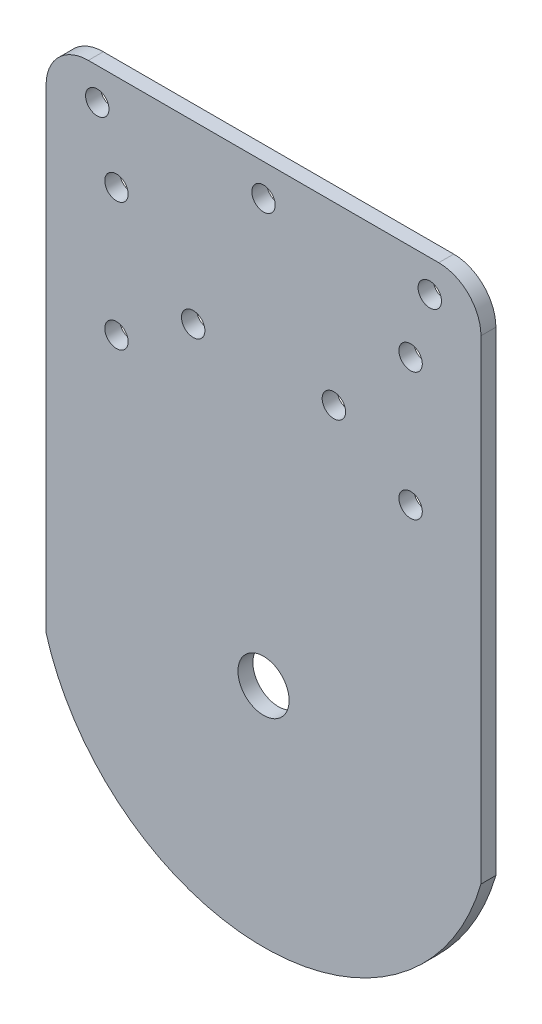
ISO-10303-21;
HEADER;
FILE_DESCRIPTION(('STEP AP214'),'2;1');
FILE_NAME('part.step','',(''),(''),'','','');
FILE_SCHEMA(('AUTOMOTIVE_DESIGN { 1 0 10303 214 1 1 1 1 }'));
ENDSEC;
DATA;
#1=APPLICATION_CONTEXT('core data for automotive mechanical design processes');
#2=APPLICATION_PROTOCOL_DEFINITION('international standard','automotive_design',2000,#1);
#3=PRODUCT_CONTEXT('',#1,'mechanical');
#4=PRODUCT('Part','Part','',(#3));
#5=PRODUCT_RELATED_PRODUCT_CATEGORY('part','',(#4));
#6=PRODUCT_DEFINITION_FORMATION('','',#4);
#7=PRODUCT_DEFINITION_CONTEXT('part definition',#1,'design');
#8=PRODUCT_DEFINITION('design','',#6,#7);
#9=PRODUCT_DEFINITION_SHAPE('','',#8);
#10=(LENGTH_UNIT() NAMED_UNIT(*) SI_UNIT(.MILLI.,.METRE.));
#11=(NAMED_UNIT(*) PLANE_ANGLE_UNIT() SI_UNIT($,.RADIAN.));
#12=(NAMED_UNIT(*) SI_UNIT($,.STERADIAN.) SOLID_ANGLE_UNIT());
#13=UNCERTAINTY_MEASURE_WITH_UNIT(LENGTH_MEASURE(1.E-05),#10,'distance_accuracy_value','');
#14=(GEOMETRIC_REPRESENTATION_CONTEXT(3) GLOBAL_UNCERTAINTY_ASSIGNED_CONTEXT((#13)) GLOBAL_UNIT_ASSIGNED_CONTEXT((#10,
#11,#12)) REPRESENTATION_CONTEXT('',''));
#15=CARTESIAN_POINT('',(0.,0.,0.));
#16=DIRECTION('',(0.,0.,1.));
#17=DIRECTION('',(1.,0.,0.));
#18=AXIS2_PLACEMENT_3D('',#15,#16,#17);
#19=CARTESIAN_POINT('',(0.,0.,2.3368));
#20=DIRECTION('',(0.,0.,1.));
#21=DIRECTION('',(1.,0.,0.));
#22=AXIS2_PLACEMENT_3D('',#19,#20,#21);
#23=PLANE('',#22);
#24=CARTESIAN_POINT('',(-2.15991369565433E-12,66.0000000000004,2.3368));
#25=DIRECTION('',(0.,0.,1.));
#26=DIRECTION('',(1.,0.,0.));
#27=AXIS2_PLACEMENT_3D('',#24,#25,#26);
#28=CIRCLE('',#27,1.8288);
#29=CARTESIAN_POINT('',(1.82879999999784,66.0000000000004,2.3368));
#30=VERTEX_POINT('',#29);
#31=EDGE_CURVE('E318',#30,#30,#28,.T.);
#32=ORIENTED_EDGE('',*,*,#31,.F.);
#33=EDGE_LOOP('',(#32));
#34=FACE_BOUND('',#33,.T.);
#35=CARTESIAN_POINT('',(10.9999999999978,43.5000000000004,2.3368));
#36=DIRECTION('',(0.,0.,1.));
#37=DIRECTION('',(1.,0.,0.));
#38=AXIS2_PLACEMENT_3D('',#35,#36,#37);
#39=CIRCLE('',#38,1.8288);
#40=CARTESIAN_POINT('',(12.8287999999978,43.5000000000004,2.3368));
#41=VERTEX_POINT('',#40);
#42=EDGE_CURVE('E320',#41,#41,#39,.T.);
#43=ORIENTED_EDGE('',*,*,#42,.F.);
#44=EDGE_LOOP('',(#43));
#45=FACE_BOUND('',#44,.T.);
#46=CARTESIAN_POINT('',(22.9999999999978,36.0000000000004,2.3368));
#47=DIRECTION('',(0.,0.,1.));
#48=DIRECTION('',(1.,0.,0.));
#49=AXIS2_PLACEMENT_3D('',#46,#47,#48);
#50=CIRCLE('',#49,1.8288);
#51=CARTESIAN_POINT('',(24.8287999999978,36.0000000000004,2.3368));
#52=VERTEX_POINT('',#51);
#53=EDGE_CURVE('E328',#52,#52,#50,.T.);
#54=ORIENTED_EDGE('',*,*,#53,.F.);
#55=EDGE_LOOP('',(#54));
#56=FACE_BOUND('',#55,.T.);
#57=CARTESIAN_POINT('',(22.9999999999978,56.0000000000004,2.3368));
#58=DIRECTION('',(0.,0.,1.));
#59=DIRECTION('',(1.,0.,0.));
#60=AXIS2_PLACEMENT_3D('',#57,#58,#59);
#61=CIRCLE('',#60,1.8288);
#62=CARTESIAN_POINT('',(24.8287999999978,56.0000000000004,2.3368));
#63=VERTEX_POINT('',#62);
#64=EDGE_CURVE('E334',#63,#63,#61,.T.);
#65=ORIENTED_EDGE('',*,*,#64,.F.);
#66=EDGE_LOOP('',(#65));
#67=FACE_BOUND('',#66,.T.);
#68=CARTESIAN_POINT('',(25.9999999999978,66.0000000000004,2.3368));
#69=DIRECTION('',(0.,0.,1.));
#70=DIRECTION('',(1.,0.,0.));
#71=AXIS2_PLACEMENT_3D('',#68,#69,#70);
#72=CIRCLE('',#71,1.8288);
#73=CARTESIAN_POINT('',(27.8287999999978,66.0000000000004,2.3368));
#74=VERTEX_POINT('',#73);
#75=EDGE_CURVE('E340',#74,#74,#72,.T.);
#76=ORIENTED_EDGE('',*,*,#75,.F.);
#77=EDGE_LOOP('',(#76));
#78=FACE_BOUND('',#77,.T.);
#79=CARTESIAN_POINT('',(-22.9999999999978,36.0000000000004,2.3368));
#80=DIRECTION('',(0.,0.,1.));
#81=DIRECTION('',(1.,0.,0.));
#82=AXIS2_PLACEMENT_3D('',#79,#80,#81);
#83=CIRCLE('',#82,1.8288);
#84=CARTESIAN_POINT('',(-21.1711999999978,36.0000000000004,2.3368));
#85=VERTEX_POINT('',#84);
#86=EDGE_CURVE('E346',#85,#85,#83,.T.);
#87=ORIENTED_EDGE('',*,*,#86,.F.);
#88=EDGE_LOOP('',(#87));
#89=FACE_BOUND('',#88,.T.);
#90=CARTESIAN_POINT('',(-10.9999999999978,43.5000000000004,2.3368));
#91=DIRECTION('',(0.,0.,1.));
#92=DIRECTION('',(1.,0.,0.));
#93=AXIS2_PLACEMENT_3D('',#90,#91,#92);
#94=CIRCLE('',#93,1.8288);
#95=CARTESIAN_POINT('',(-9.17119999999779,43.5000000000004,2.3368));
#96=VERTEX_POINT('',#95);
#97=EDGE_CURVE('E352',#96,#96,#94,.T.);
#98=ORIENTED_EDGE('',*,*,#97,.F.);
#99=EDGE_LOOP('',(#98));
#100=FACE_BOUND('',#99,.T.);
#101=CARTESIAN_POINT('',(-22.9999999999978,56.0000000000004,2.3368));
#102=DIRECTION('',(0.,0.,1.));
#103=DIRECTION('',(1.,0.,0.));
#104=AXIS2_PLACEMENT_3D('',#101,#102,#103);
#105=CIRCLE('',#104,1.8288);
#106=CARTESIAN_POINT('',(-21.1711999999978,56.0000000000004,2.3368));
#107=VERTEX_POINT('',#106);
#108=EDGE_CURVE('E358',#107,#107,#105,.T.);
#109=ORIENTED_EDGE('',*,*,#108,.F.);
#110=EDGE_LOOP('',(#109));
#111=FACE_BOUND('',#110,.T.);
#112=CARTESIAN_POINT('',(-25.9999999999978,66.0000000000004,2.3368));
#113=DIRECTION('',(0.,0.,1.));
#114=DIRECTION('',(1.,0.,0.));
#115=AXIS2_PLACEMENT_3D('',#112,#113,#114);
#116=CIRCLE('',#115,1.8288);
#117=CARTESIAN_POINT('',(-24.1711999999978,66.0000000000004,2.3368));
#118=VERTEX_POINT('',#117);
#119=EDGE_CURVE('E364',#118,#118,#116,.T.);
#120=ORIENTED_EDGE('',*,*,#119,.F.);
#121=EDGE_LOOP('',(#120));
#122=FACE_BOUND('',#121,.T.);
#123=DIRECTION('',(0.,1.,0.));
#124=VECTOR('',#123,1.);
#125=CARTESIAN_POINT('',(33.9999999999978,-9.85697722428106,2.3368));
#126=LINE('',#125,#124);
#127=CARTESIAN_POINT('',(33.9999999999978,-9.85697722428106,2.3368));
#128=VERTEX_POINT('',#127);
#129=CARTESIAN_POINT('',(33.9999999999978,64.4000000000004,2.3368));
#130=VERTEX_POINT('',#129);
#131=EDGE_CURVE('E86',#128,#130,#126,.T.);
#132=ORIENTED_EDGE('',*,*,#131,.T.);
#133=CARTESIAN_POINT('',(27.3999999999978,64.4000000000004,2.3368));
#134=DIRECTION('',(0.,0.,1.));
#135=DIRECTION('',(1.,0.,0.));
#136=AXIS2_PLACEMENT_3D('',#133,#134,#135);
#137=CIRCLE('',#136,6.6);
#138=CARTESIAN_POINT('',(27.3999999999978,71.0000000000004,2.3368));
#139=VERTEX_POINT('',#138);
#140=EDGE_CURVE('E41',#130,#139,#137,.T.);
#141=ORIENTED_EDGE('',*,*,#140,.T.);
#142=DIRECTION('',(-1.,0.,0.));
#143=VECTOR('',#142,1.);
#144=CARTESIAN_POINT('',(33.9999999999978,71.0000000000004,2.3368));
#145=LINE('',#144,#143);
#146=CARTESIAN_POINT('',(-27.4000000000022,71.0000000000004,2.3368));
#147=VERTEX_POINT('',#146);
#148=EDGE_CURVE('E93',#139,#147,#145,.T.);
#149=ORIENTED_EDGE('',*,*,#148,.T.);
#150=CARTESIAN_POINT('',(-27.4000000000022,64.4000000000004,2.3368));
#151=DIRECTION('',(0.,0.,1.));
#152=DIRECTION('',(1.,0.,0.));
#153=AXIS2_PLACEMENT_3D('',#150,#151,#152);
#154=CIRCLE('',#153,6.6);
#155=CARTESIAN_POINT('',(-34.0000000000022,64.4000000000004,2.3368));
#156=VERTEX_POINT('',#155);
#157=EDGE_CURVE('E48',#147,#156,#154,.T.);
#158=ORIENTED_EDGE('',*,*,#157,.T.);
#159=DIRECTION('',(0.,-1.,0.));
#160=VECTOR('',#159,1.);
#161=CARTESIAN_POINT('',(-34.0000000000022,-9.85697722428104,2.3368));
#162=LINE('',#161,#160);
#163=CARTESIAN_POINT('',(-34.0000000000022,-9.85697722428104,2.3368));
#164=VERTEX_POINT('',#163);
#165=EDGE_CURVE('E98',#156,#164,#162,.T.);
#166=ORIENTED_EDGE('',*,*,#165,.T.);
#167=CARTESIAN_POINT('',(0.,0.,2.3368));
#168=DIRECTION('',(0.,0.,1.));
#169=DIRECTION('',(1.,0.,0.));
#170=AXIS2_PLACEMENT_3D('',#167,#168,#169);
#171=CIRCLE('',#170,35.3999999999999);
#172=EDGE_CURVE('E94',#164,#128,#171,.T.);
#173=ORIENTED_EDGE('',*,*,#172,.T.);
#174=EDGE_LOOP('',(#132,#141,#149,#158,#166,#173));
#175=FACE_BOUND('',#174,.T.);
#176=CARTESIAN_POINT('',(0.,0.,2.3368));
#177=DIRECTION('',(0.,0.,1.));
#178=DIRECTION('',(1.,0.,0.));
#179=AXIS2_PLACEMENT_3D('',#176,#177,#178);
#180=CIRCLE('',#179,4.);
#181=CARTESIAN_POINT('',(4.,0.,2.3368));
#182=VERTEX_POINT('',#181);
#183=EDGE_CURVE('E139',#182,#182,#180,.T.);
#184=ORIENTED_EDGE('',*,*,#183,.F.);
#185=EDGE_LOOP('',(#184));
#186=FACE_BOUND('',#185,.T.);
#187=ADVANCED_FACE('F33',(#34,#45,#56,#67,#78,#89,#100,#111,#122,#175,#186),#23,.T.);
#188=CARTESIAN_POINT('',(0.,0.,0.));
#189=DIRECTION('',(0.,0.,1.));
#190=DIRECTION('',(1.,0.,0.));
#191=AXIS2_PLACEMENT_3D('',#188,#189,#190);
#192=PLANE('',#191);
#193=CARTESIAN_POINT('',(-2.15991369565433E-12,66.0000000000004,0.));
#194=DIRECTION('',(0.,0.,1.));
#195=DIRECTION('',(1.,0.,0.));
#196=AXIS2_PLACEMENT_3D('',#193,#194,#195);
#197=CIRCLE('',#196,1.8288);
#198=CARTESIAN_POINT('',(1.82879999999784,66.0000000000004,0.));
#199=VERTEX_POINT('',#198);
#200=EDGE_CURVE('E316',#199,#199,#197,.T.);
#201=ORIENTED_EDGE('',*,*,#200,.T.);
#202=EDGE_LOOP('',(#201));
#203=FACE_BOUND('',#202,.T.);
#204=CARTESIAN_POINT('',(10.9999999999978,43.5000000000004,0.));
#205=DIRECTION('',(0.,0.,1.));
#206=DIRECTION('',(1.,0.,0.));
#207=AXIS2_PLACEMENT_3D('',#204,#205,#206);
#208=CIRCLE('',#207,1.8288);
#209=CARTESIAN_POINT('',(12.8287999999978,43.5000000000004,0.));
#210=VERTEX_POINT('',#209);
#211=EDGE_CURVE('E325',#210,#210,#208,.T.);
#212=ORIENTED_EDGE('',*,*,#211,.T.);
#213=EDGE_LOOP('',(#212));
#214=FACE_BOUND('',#213,.T.);
#215=CARTESIAN_POINT('',(22.9999999999978,36.0000000000004,0.));
#216=DIRECTION('',(0.,0.,1.));
#217=DIRECTION('',(1.,0.,0.));
#218=AXIS2_PLACEMENT_3D('',#215,#216,#217);
#219=CIRCLE('',#218,1.8288);
#220=CARTESIAN_POINT('',(24.8287999999978,36.0000000000004,0.));
#221=VERTEX_POINT('',#220);
#222=EDGE_CURVE('E331',#221,#221,#219,.T.);
#223=ORIENTED_EDGE('',*,*,#222,.T.);
#224=EDGE_LOOP('',(#223));
#225=FACE_BOUND('',#224,.T.);
#226=CARTESIAN_POINT('',(22.9999999999978,56.0000000000004,0.));
#227=DIRECTION('',(0.,0.,1.));
#228=DIRECTION('',(1.,0.,0.));
#229=AXIS2_PLACEMENT_3D('',#226,#227,#228);
#230=CIRCLE('',#229,1.8288);
#231=CARTESIAN_POINT('',(24.8287999999978,56.0000000000004,0.));
#232=VERTEX_POINT('',#231);
#233=EDGE_CURVE('E337',#232,#232,#230,.T.);
#234=ORIENTED_EDGE('',*,*,#233,.T.);
#235=EDGE_LOOP('',(#234));
#236=FACE_BOUND('',#235,.T.);
#237=CARTESIAN_POINT('',(25.9999999999978,66.0000000000004,0.));
#238=DIRECTION('',(0.,0.,1.));
#239=DIRECTION('',(1.,0.,0.));
#240=AXIS2_PLACEMENT_3D('',#237,#238,#239);
#241=CIRCLE('',#240,1.8288);
#242=CARTESIAN_POINT('',(27.8287999999978,66.0000000000004,0.));
#243=VERTEX_POINT('',#242);
#244=EDGE_CURVE('E343',#243,#243,#241,.T.);
#245=ORIENTED_EDGE('',*,*,#244,.T.);
#246=EDGE_LOOP('',(#245));
#247=FACE_BOUND('',#246,.T.);
#248=CARTESIAN_POINT('',(-22.9999999999978,36.0000000000004,0.));
#249=DIRECTION('',(0.,0.,1.));
#250=DIRECTION('',(1.,0.,0.));
#251=AXIS2_PLACEMENT_3D('',#248,#249,#250);
#252=CIRCLE('',#251,1.8288);
#253=CARTESIAN_POINT('',(-21.1711999999978,36.0000000000004,0.));
#254=VERTEX_POINT('',#253);
#255=EDGE_CURVE('E349',#254,#254,#252,.T.);
#256=ORIENTED_EDGE('',*,*,#255,.T.);
#257=EDGE_LOOP('',(#256));
#258=FACE_BOUND('',#257,.T.);
#259=CARTESIAN_POINT('',(-10.9999999999978,43.5000000000004,0.));
#260=DIRECTION('',(0.,0.,1.));
#261=DIRECTION('',(1.,0.,0.));
#262=AXIS2_PLACEMENT_3D('',#259,#260,#261);
#263=CIRCLE('',#262,1.8288);
#264=CARTESIAN_POINT('',(-9.17119999999779,43.5000000000004,0.));
#265=VERTEX_POINT('',#264);
#266=EDGE_CURVE('E355',#265,#265,#263,.T.);
#267=ORIENTED_EDGE('',*,*,#266,.T.);
#268=EDGE_LOOP('',(#267));
#269=FACE_BOUND('',#268,.T.);
#270=CARTESIAN_POINT('',(-22.9999999999978,56.0000000000004,0.));
#271=DIRECTION('',(0.,0.,1.));
#272=DIRECTION('',(1.,0.,0.));
#273=AXIS2_PLACEMENT_3D('',#270,#271,#272);
#274=CIRCLE('',#273,1.8288);
#275=CARTESIAN_POINT('',(-21.1711999999978,56.0000000000004,0.));
#276=VERTEX_POINT('',#275);
#277=EDGE_CURVE('E361',#276,#276,#274,.T.);
#278=ORIENTED_EDGE('',*,*,#277,.T.);
#279=EDGE_LOOP('',(#278));
#280=FACE_BOUND('',#279,.T.);
#281=CARTESIAN_POINT('',(-25.9999999999978,66.0000000000004,0.));
#282=DIRECTION('',(0.,0.,1.));
#283=DIRECTION('',(1.,0.,0.));
#284=AXIS2_PLACEMENT_3D('',#281,#282,#283);
#285=CIRCLE('',#284,1.8288);
#286=CARTESIAN_POINT('',(-24.1711999999978,66.0000000000004,0.));
#287=VERTEX_POINT('',#286);
#288=EDGE_CURVE('E367',#287,#287,#285,.T.);
#289=ORIENTED_EDGE('',*,*,#288,.T.);
#290=EDGE_LOOP('',(#289));
#291=FACE_BOUND('',#290,.T.);
#292=DIRECTION('',(-1.,0.,0.));
#293=VECTOR('',#292,1.);
#294=CARTESIAN_POINT('',(33.9999999999978,71.0000000000004,0.));
#295=LINE('',#294,#293);
#296=CARTESIAN_POINT('',(27.3999999999978,71.0000000000004,0.));
#297=VERTEX_POINT('',#296);
#298=CARTESIAN_POINT('',(-27.4000000000022,71.0000000000004,0.));
#299=VERTEX_POINT('',#298);
#300=EDGE_CURVE('E136',#297,#299,#295,.T.);
#301=ORIENTED_EDGE('',*,*,#300,.F.);
#302=CARTESIAN_POINT('',(27.3999999999978,64.4000000000004,0.));
#303=DIRECTION('',(0.,0.,1.));
#304=DIRECTION('',(1.,0.,0.));
#305=AXIS2_PLACEMENT_3D('',#302,#303,#304);
#306=CIRCLE('',#305,6.6);
#307=CARTESIAN_POINT('',(33.9999999999978,64.4000000000004,0.));
#308=VERTEX_POINT('',#307);
#309=EDGE_CURVE('E119',#297,#308,#306,.F.);
#310=ORIENTED_EDGE('',*,*,#309,.T.);
#311=DIRECTION('',(0.,1.,0.));
#312=VECTOR('',#311,1.);
#313=CARTESIAN_POINT('',(33.9999999999978,-9.85697722428106,0.));
#314=LINE('',#313,#312);
#315=CARTESIAN_POINT('',(33.9999999999978,-9.85697722428106,0.));
#316=VERTEX_POINT('',#315);
#317=EDGE_CURVE('E135',#316,#308,#314,.T.);
#318=ORIENTED_EDGE('',*,*,#317,.F.);
#319=CARTESIAN_POINT('',(0.,0.,0.));
#320=DIRECTION('',(0.,0.,1.));
#321=DIRECTION('',(1.,0.,0.));
#322=AXIS2_PLACEMENT_3D('',#319,#320,#321);
#323=CIRCLE('',#322,35.3999999999999);
#324=CARTESIAN_POINT('',(-34.0000000000022,-9.85697722428104,0.));
#325=VERTEX_POINT('',#324);
#326=EDGE_CURVE('E106',#325,#316,#323,.T.);
#327=ORIENTED_EDGE('',*,*,#326,.F.);
#328=DIRECTION('',(0.,-1.,0.));
#329=VECTOR('',#328,1.);
#330=CARTESIAN_POINT('',(-34.0000000000022,-9.85697722428104,0.));
#331=LINE('',#330,#329);
#332=CARTESIAN_POINT('',(-34.0000000000022,64.4000000000004,0.));
#333=VERTEX_POINT('',#332);
#334=EDGE_CURVE('E102',#333,#325,#331,.T.);
#335=ORIENTED_EDGE('',*,*,#334,.F.);
#336=CARTESIAN_POINT('',(-27.4000000000022,64.4000000000004,0.));
#337=DIRECTION('',(0.,0.,1.));
#338=DIRECTION('',(1.,0.,0.));
#339=AXIS2_PLACEMENT_3D('',#336,#337,#338);
#340=CIRCLE('',#339,6.6);
#341=EDGE_CURVE('E117',#333,#299,#340,.F.);
#342=ORIENTED_EDGE('',*,*,#341,.T.);
#343=EDGE_LOOP('',(#301,#310,#318,#327,#335,#342));
#344=FACE_BOUND('',#343,.T.);
#345=CARTESIAN_POINT('',(0.,0.,0.));
#346=DIRECTION('',(0.,0.,1.));
#347=DIRECTION('',(1.,0.,0.));
#348=AXIS2_PLACEMENT_3D('',#345,#346,#347);
#349=CIRCLE('',#348,4.);
#350=CARTESIAN_POINT('',(4.,0.,0.));
#351=VERTEX_POINT('',#350);
#352=EDGE_CURVE('E370',#351,#351,#349,.T.);
#353=ORIENTED_EDGE('',*,*,#352,.T.);
#354=EDGE_LOOP('',(#353));
#355=FACE_BOUND('',#354,.T.);
#356=ADVANCED_FACE('F133',(#203,#214,#225,#236,#247,#258,#269,#280,#291,#344,#355),#192,.F.);
#357=CARTESIAN_POINT('',(0.,0.,2.3368));
#358=DIRECTION('',(0.,0.,-1.));
#359=DIRECTION('',(-1.,0.,0.));
#360=AXIS2_PLACEMENT_3D('',#357,#358,#359);
#361=CYLINDRICAL_SURFACE('',#360,35.3999999999999);
#362=ORIENTED_EDGE('',*,*,#326,.T.);
#363=DIRECTION('',(0.,0.,-1.));
#364=VECTOR('',#363,1.);
#365=CARTESIAN_POINT('',(33.9999999999978,-9.85697722428106,2.3368));
#366=LINE('',#365,#364);
#367=EDGE_CURVE('E90',#128,#316,#366,.T.);
#368=ORIENTED_EDGE('',*,*,#367,.F.);
#369=ORIENTED_EDGE('',*,*,#172,.F.);
#370=DIRECTION('',(0.,0.,-1.));
#371=VECTOR('',#370,1.);
#372=CARTESIAN_POINT('',(-34.0000000000022,-9.85697722428104,2.3368));
#373=LINE('',#372,#371);
#374=EDGE_CURVE('E108',#164,#325,#373,.T.);
#375=ORIENTED_EDGE('',*,*,#374,.T.);
#376=EDGE_LOOP('',(#362,#368,#369,#375));
#377=FACE_BOUND('',#376,.T.);
#378=ADVANCED_FACE('F104',(#377),#361,.T.);
#379=CARTESIAN_POINT('',(33.9999999999978,-9.85697722428106,2.3368));
#380=DIRECTION('',(-1.,0.,0.));
#381=DIRECTION('',(0.,-1.,0.));
#382=AXIS2_PLACEMENT_3D('',#379,#380,#381);
#383=PLANE('',#382);
#384=ORIENTED_EDGE('',*,*,#317,.T.);
#385=DIRECTION('',(0.,0.,-1.));
#386=VECTOR('',#385,1.);
#387=CARTESIAN_POINT('',(33.9999999999978,64.4000000000004,2.3368));
#388=LINE('',#387,#386);
#389=EDGE_CURVE('E56',#308,#130,#388,.F.);
#390=ORIENTED_EDGE('',*,*,#389,.T.);
#391=ORIENTED_EDGE('',*,*,#131,.F.);
#392=ORIENTED_EDGE('',*,*,#367,.T.);
#393=EDGE_LOOP('',(#384,#390,#391,#392));
#394=FACE_BOUND('',#393,.T.);
#395=ADVANCED_FACE('F88',(#394),#383,.F.);
#396=CARTESIAN_POINT('',(33.9999999999978,71.0000000000004,2.3368));
#397=DIRECTION('',(0.,-1.,0.));
#398=DIRECTION('',(0.,0.,-1.));
#399=AXIS2_PLACEMENT_3D('',#396,#397,#398);
#400=PLANE('',#399);
#401=ORIENTED_EDGE('',*,*,#148,.F.);
#402=DIRECTION('',(0.,0.,-1.));
#403=VECTOR('',#402,1.);
#404=CARTESIAN_POINT('',(27.3999999999978,71.0000000000004,2.3368));
#405=LINE('',#404,#403);
#406=EDGE_CURVE('E110',#139,#297,#405,.T.);
#407=ORIENTED_EDGE('',*,*,#406,.T.);
#408=ORIENTED_EDGE('',*,*,#300,.T.);
#409=DIRECTION('',(0.,0.,-1.));
#410=VECTOR('',#409,1.);
#411=CARTESIAN_POINT('',(-27.4000000000022,71.0000000000004,2.3368));
#412=LINE('',#411,#410);
#413=EDGE_CURVE('E107',#299,#147,#412,.F.);
#414=ORIENTED_EDGE('',*,*,#413,.T.);
#415=EDGE_LOOP('',(#401,#407,#408,#414));
#416=FACE_BOUND('',#415,.T.);
#417=ADVANCED_FACE('F126',(#416),#400,.F.);
#418=CARTESIAN_POINT('',(-34.0000000000022,-9.85697722428104,2.3368));
#419=DIRECTION('',(1.,0.,0.));
#420=DIRECTION('',(0.,1.,0.));
#421=AXIS2_PLACEMENT_3D('',#418,#419,#420);
#422=PLANE('',#421);
#423=ORIENTED_EDGE('',*,*,#165,.F.);
#424=DIRECTION('',(0.,0.,-1.));
#425=VECTOR('',#424,1.);
#426=CARTESIAN_POINT('',(-34.0000000000022,64.4000000000004,2.3368));
#427=LINE('',#426,#425);
#428=EDGE_CURVE('E11',#156,#333,#427,.T.);
#429=ORIENTED_EDGE('',*,*,#428,.T.);
#430=ORIENTED_EDGE('',*,*,#334,.T.);
#431=ORIENTED_EDGE('',*,*,#374,.F.);
#432=EDGE_LOOP('',(#423,#429,#430,#431));
#433=FACE_BOUND('',#432,.T.);
#434=ADVANCED_FACE('F144',(#433),#422,.F.);
#435=CARTESIAN_POINT('',(0.,0.,2.3368));
#436=DIRECTION('',(0.,0.,-1.));
#437=DIRECTION('',(-1.,0.,0.));
#438=AXIS2_PLACEMENT_3D('',#435,#436,#437);
#439=CYLINDRICAL_SURFACE('',#438,4.);
#440=ORIENTED_EDGE('',*,*,#183,.T.);
#441=EDGE_LOOP('',(#440));
#442=FACE_BOUND('',#441,.T.);
#443=ORIENTED_EDGE('',*,*,#352,.F.);
#444=EDGE_LOOP('',(#443));
#445=FACE_BOUND('',#444,.T.);
#446=ADVANCED_FACE('F163',(#442,#445),#439,.F.);
#447=CARTESIAN_POINT('',(-25.9999999999978,66.0000000000004,2.3368));
#448=DIRECTION('',(0.,0.,1.));
#449=DIRECTION('',(1.,0.,0.));
#450=AXIS2_PLACEMENT_3D('',#447,#448,#449);
#451=CYLINDRICAL_SURFACE('',#450,1.8288);
#452=ORIENTED_EDGE('',*,*,#288,.F.);
#453=EDGE_LOOP('',(#452));
#454=FACE_BOUND('',#453,.T.);
#455=ORIENTED_EDGE('',*,*,#119,.T.);
#456=EDGE_LOOP('',(#455));
#457=FACE_BOUND('',#456,.T.);
#458=ADVANCED_FACE('F196',(#454,#457),#451,.F.);
#459=CARTESIAN_POINT('',(-22.9999999999978,56.0000000000004,2.3368));
#460=DIRECTION('',(0.,0.,1.));
#461=DIRECTION('',(1.,0.,0.));
#462=AXIS2_PLACEMENT_3D('',#459,#460,#461);
#463=CYLINDRICAL_SURFACE('',#462,1.8288);
#464=ORIENTED_EDGE('',*,*,#277,.F.);
#465=EDGE_LOOP('',(#464));
#466=FACE_BOUND('',#465,.T.);
#467=ORIENTED_EDGE('',*,*,#108,.T.);
#468=EDGE_LOOP('',(#467));
#469=FACE_BOUND('',#468,.T.);
#470=ADVANCED_FACE('F203',(#466,#469),#463,.F.);
#471=CARTESIAN_POINT('',(-10.9999999999978,43.5000000000004,2.3368));
#472=DIRECTION('',(0.,0.,1.));
#473=DIRECTION('',(1.,0.,0.));
#474=AXIS2_PLACEMENT_3D('',#471,#472,#473);
#475=CYLINDRICAL_SURFACE('',#474,1.8288);
#476=ORIENTED_EDGE('',*,*,#266,.F.);
#477=EDGE_LOOP('',(#476));
#478=FACE_BOUND('',#477,.T.);
#479=ORIENTED_EDGE('',*,*,#97,.T.);
#480=EDGE_LOOP('',(#479));
#481=FACE_BOUND('',#480,.T.);
#482=ADVANCED_FACE('F210',(#478,#481),#475,.F.);
#483=CARTESIAN_POINT('',(-22.9999999999978,36.0000000000004,2.3368));
#484=DIRECTION('',(0.,0.,1.));
#485=DIRECTION('',(1.,0.,0.));
#486=AXIS2_PLACEMENT_3D('',#483,#484,#485);
#487=CYLINDRICAL_SURFACE('',#486,1.8288);
#488=ORIENTED_EDGE('',*,*,#255,.F.);
#489=EDGE_LOOP('',(#488));
#490=FACE_BOUND('',#489,.T.);
#491=ORIENTED_EDGE('',*,*,#86,.T.);
#492=EDGE_LOOP('',(#491));
#493=FACE_BOUND('',#492,.T.);
#494=ADVANCED_FACE('F218',(#490,#493),#487,.F.);
#495=CARTESIAN_POINT('',(25.9999999999978,66.0000000000004,2.3368));
#496=DIRECTION('',(0.,0.,1.));
#497=DIRECTION('',(1.,0.,0.));
#498=AXIS2_PLACEMENT_3D('',#495,#496,#497);
#499=CYLINDRICAL_SURFACE('',#498,1.8288);
#500=ORIENTED_EDGE('',*,*,#244,.F.);
#501=EDGE_LOOP('',(#500));
#502=FACE_BOUND('',#501,.T.);
#503=ORIENTED_EDGE('',*,*,#75,.T.);
#504=EDGE_LOOP('',(#503));
#505=FACE_BOUND('',#504,.T.);
#506=ADVANCED_FACE('F226',(#502,#505),#499,.F.);
#507=CARTESIAN_POINT('',(22.9999999999978,56.0000000000004,2.3368));
#508=DIRECTION('',(0.,0.,1.));
#509=DIRECTION('',(1.,0.,0.));
#510=AXIS2_PLACEMENT_3D('',#507,#508,#509);
#511=CYLINDRICAL_SURFACE('',#510,1.8288);
#512=ORIENTED_EDGE('',*,*,#233,.F.);
#513=EDGE_LOOP('',(#512));
#514=FACE_BOUND('',#513,.T.);
#515=ORIENTED_EDGE('',*,*,#64,.T.);
#516=EDGE_LOOP('',(#515));
#517=FACE_BOUND('',#516,.T.);
#518=ADVANCED_FACE('F234',(#514,#517),#511,.F.);
#519=CARTESIAN_POINT('',(22.9999999999978,36.0000000000004,2.3368));
#520=DIRECTION('',(0.,0.,1.));
#521=DIRECTION('',(1.,0.,0.));
#522=AXIS2_PLACEMENT_3D('',#519,#520,#521);
#523=CYLINDRICAL_SURFACE('',#522,1.8288);
#524=ORIENTED_EDGE('',*,*,#222,.F.);
#525=EDGE_LOOP('',(#524));
#526=FACE_BOUND('',#525,.T.);
#527=ORIENTED_EDGE('',*,*,#53,.T.);
#528=EDGE_LOOP('',(#527));
#529=FACE_BOUND('',#528,.T.);
#530=ADVANCED_FACE('F242',(#526,#529),#523,.F.);
#531=CARTESIAN_POINT('',(10.9999999999978,43.5000000000004,2.3368));
#532=DIRECTION('',(0.,0.,1.));
#533=DIRECTION('',(1.,0.,0.));
#534=AXIS2_PLACEMENT_3D('',#531,#532,#533);
#535=CYLINDRICAL_SURFACE('',#534,1.8288);
#536=ORIENTED_EDGE('',*,*,#211,.F.);
#537=EDGE_LOOP('',(#536));
#538=FACE_BOUND('',#537,.T.);
#539=ORIENTED_EDGE('',*,*,#42,.T.);
#540=EDGE_LOOP('',(#539));
#541=FACE_BOUND('',#540,.T.);
#542=ADVANCED_FACE('F250',(#538,#541),#535,.F.);
#543=CARTESIAN_POINT('',(-2.15991369565433E-12,66.0000000000004,2.3368));
#544=DIRECTION('',(0.,0.,1.));
#545=DIRECTION('',(1.,0.,0.));
#546=AXIS2_PLACEMENT_3D('',#543,#544,#545);
#547=CYLINDRICAL_SURFACE('',#546,1.8288);
#548=ORIENTED_EDGE('',*,*,#200,.F.);
#549=EDGE_LOOP('',(#548));
#550=FACE_BOUND('',#549,.T.);
#551=ORIENTED_EDGE('',*,*,#31,.T.);
#552=EDGE_LOOP('',(#551));
#553=FACE_BOUND('',#552,.T.);
#554=ADVANCED_FACE('F151',(#550,#553),#547,.F.);
#555=CARTESIAN_POINT('',(27.3999999999978,64.4000000000004,2.3368));
#556=DIRECTION('',(0.,0.,-1.));
#557=DIRECTION('',(-1.,0.,0.));
#558=AXIS2_PLACEMENT_3D('',#555,#556,#557);
#559=CYLINDRICAL_SURFACE('',#558,6.6);
#560=ORIENTED_EDGE('',*,*,#140,.F.);
#561=ORIENTED_EDGE('',*,*,#389,.F.);
#562=ORIENTED_EDGE('',*,*,#309,.F.);
#563=ORIENTED_EDGE('',*,*,#406,.F.);
#564=EDGE_LOOP('',(#560,#561,#562,#563));
#565=FACE_BOUND('',#564,.T.);
#566=ADVANCED_FACE('F131',(#565),#559,.T.);
#567=CARTESIAN_POINT('',(-27.4000000000022,64.4000000000004,2.3368));
#568=DIRECTION('',(0.,0.,-1.));
#569=DIRECTION('',(-1.,0.,0.));
#570=AXIS2_PLACEMENT_3D('',#567,#568,#569);
#571=CYLINDRICAL_SURFACE('',#570,6.6);
#572=ORIENTED_EDGE('',*,*,#157,.F.);
#573=ORIENTED_EDGE('',*,*,#413,.F.);
#574=ORIENTED_EDGE('',*,*,#341,.F.);
#575=ORIENTED_EDGE('',*,*,#428,.F.);
#576=EDGE_LOOP('',(#572,#573,#574,#575));
#577=FACE_BOUND('',#576,.T.);
#578=ADVANCED_FACE('F35',(#577),#571,.T.);
#579=CLOSED_SHELL('',(#187,#356,#378,#395,#417,#434,#446,#458,#470,#482,#494,#506,#518,#530,
#542,#554,#566,#578));
#580=MANIFOLD_SOLID_BREP('B2',#579);
#581=ADVANCED_BREP_SHAPE_REPRESENTATION('',(#18,#580),#14);
#582=SHAPE_DEFINITION_REPRESENTATION(#9,#581);
ENDSEC;
END-ISO-10303-21;
